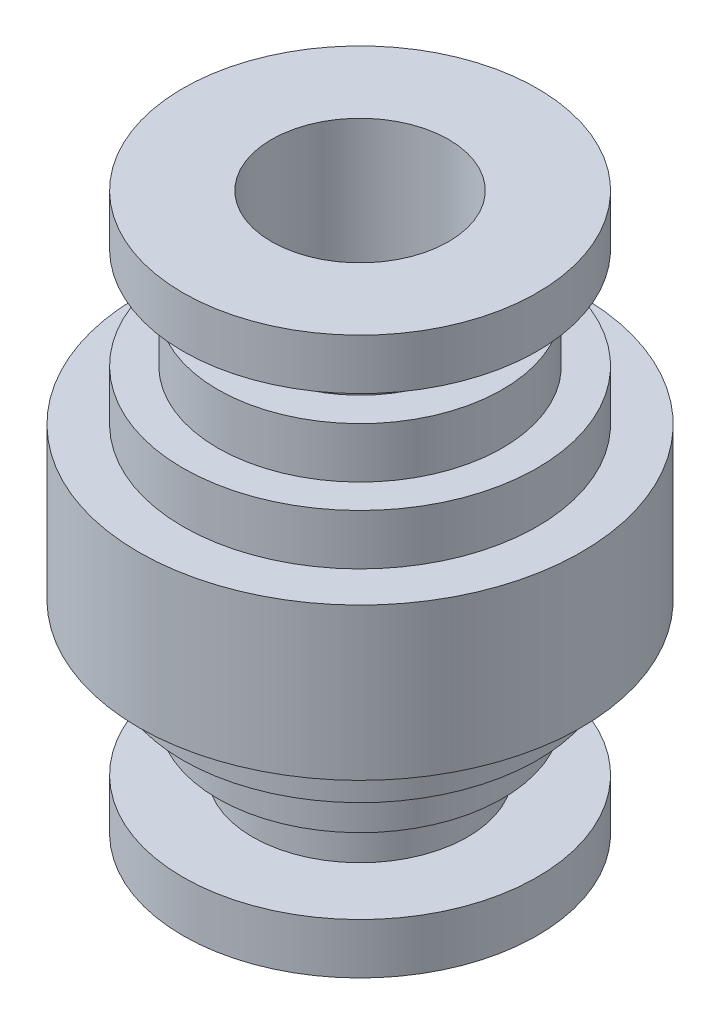
ISO-10303-21;
HEADER;
FILE_DESCRIPTION(('STEP AP214'),'2;1');
FILE_NAME('part.step','',(''),(''),'','','');
FILE_SCHEMA(('AUTOMOTIVE_DESIGN { 1 0 10303 214 1 1 1 1 }'));
ENDSEC;
DATA;
#1=APPLICATION_CONTEXT('core data for automotive mechanical design processes');
#2=APPLICATION_PROTOCOL_DEFINITION('international standard','automotive_design',2000,#1);
#3=PRODUCT_CONTEXT('',#1,'mechanical');
#4=PRODUCT('Part','Part','',(#3));
#5=PRODUCT_RELATED_PRODUCT_CATEGORY('part','',(#4));
#6=PRODUCT_DEFINITION_FORMATION('','',#4);
#7=PRODUCT_DEFINITION_CONTEXT('part definition',#1,'design');
#8=PRODUCT_DEFINITION('design','',#6,#7);
#9=PRODUCT_DEFINITION_SHAPE('','',#8);
#10=(LENGTH_UNIT() NAMED_UNIT(*) SI_UNIT(.MILLI.,.METRE.));
#11=(NAMED_UNIT(*) PLANE_ANGLE_UNIT() SI_UNIT($,.RADIAN.));
#12=(NAMED_UNIT(*) SI_UNIT($,.STERADIAN.) SOLID_ANGLE_UNIT());
#13=UNCERTAINTY_MEASURE_WITH_UNIT(LENGTH_MEASURE(1.E-05),#10,'distance_accuracy_value','');
#14=(GEOMETRIC_REPRESENTATION_CONTEXT(3) GLOBAL_UNCERTAINTY_ASSIGNED_CONTEXT((#13)) GLOBAL_UNIT_ASSIGNED_CONTEXT((#10,
#11,#12)) REPRESENTATION_CONTEXT('',''));
#15=CARTESIAN_POINT('',(0.,0.,0.));
#16=DIRECTION('',(0.,0.,1.));
#17=DIRECTION('',(1.,0.,0.));
#18=AXIS2_PLACEMENT_3D('',#15,#16,#17);
#19=CARTESIAN_POINT('',(0.,0.,0.));
#20=DIRECTION('',(0.,1.,0.));
#21=DIRECTION('',(0.,0.,1.));
#22=AXIS2_PLACEMENT_3D('',#19,#20,#21);
#23=CYLINDRICAL_SURFACE('',#22,8.75);
#24=CARTESIAN_POINT('',(0.,-3.,0.));
#25=DIRECTION('',(0.,1.,0.));
#26=DIRECTION('',(0.,0.,1.));
#27=AXIS2_PLACEMENT_3D('',#24,#25,#26);
#28=CIRCLE('',#27,8.75);
#29=CARTESIAN_POINT('',(0.,-3.,8.75));
#30=VERTEX_POINT('',#29);
#31=EDGE_CURVE('E18',#30,#30,#28,.T.);
#32=ORIENTED_EDGE('',*,*,#31,.T.);
#33=EDGE_LOOP('',(#32));
#34=FACE_BOUND('',#33,.T.);
#35=CARTESIAN_POINT('',(0.,3.,0.));
#36=DIRECTION('',(0.,1.,0.));
#37=DIRECTION('',(0.,0.,1.));
#38=AXIS2_PLACEMENT_3D('',#35,#36,#37);
#39=CIRCLE('',#38,8.75);
#40=CARTESIAN_POINT('',(0.,3.,8.75));
#41=VERTEX_POINT('',#40);
#42=EDGE_CURVE('E76',#41,#41,#39,.T.);
#43=ORIENTED_EDGE('',*,*,#42,.F.);
#44=EDGE_LOOP('',(#43));
#45=FACE_BOUND('',#44,.T.);
#46=ADVANCED_FACE('F15',(#34,#45),#23,.T.);
#47=CARTESIAN_POINT('',(0.,-3.,0.));
#48=DIRECTION('',(0.,1.,0.));
#49=DIRECTION('',(0.,0.,1.));
#50=AXIS2_PLACEMENT_3D('',#47,#48,#49);
#51=PLANE('',#50);
#52=CARTESIAN_POINT('',(0.,-3.,0.));
#53=DIRECTION('',(0.,1.,0.));
#54=DIRECTION('',(0.,0.,1.));
#55=AXIS2_PLACEMENT_3D('',#52,#53,#54);
#56=CIRCLE('',#55,7.);
#57=CARTESIAN_POINT('',(0.,-3.,7.));
#58=VERTEX_POINT('',#57);
#59=EDGE_CURVE('E74',#58,#58,#56,.F.);
#60=ORIENTED_EDGE('',*,*,#59,.F.);
#61=EDGE_LOOP('',(#60));
#62=FACE_BOUND('',#61,.T.);
#63=ORIENTED_EDGE('',*,*,#31,.F.);
#64=EDGE_LOOP('',(#63));
#65=FACE_BOUND('',#64,.T.);
#66=ADVANCED_FACE('F85',(#62,#65),#51,.F.);
#67=CARTESIAN_POINT('',(0.,3.,0.));
#68=DIRECTION('',(0.,1.,0.));
#69=DIRECTION('',(0.,0.,1.));
#70=AXIS2_PLACEMENT_3D('',#67,#68,#69);
#71=PLANE('',#70);
#72=CARTESIAN_POINT('',(0.,3.,0.));
#73=DIRECTION('',(0.,1.,0.));
#74=DIRECTION('',(0.,0.,1.));
#75=AXIS2_PLACEMENT_3D('',#72,#73,#74);
#76=CIRCLE('',#75,7.);
#77=CARTESIAN_POINT('',(0.,3.,7.));
#78=VERTEX_POINT('',#77);
#79=EDGE_CURVE('E71',#78,#78,#76,.T.);
#80=ORIENTED_EDGE('',*,*,#79,.F.);
#81=EDGE_LOOP('',(#80));
#82=FACE_BOUND('',#81,.T.);
#83=ORIENTED_EDGE('',*,*,#42,.T.);
#84=EDGE_LOOP('',(#83));
#85=FACE_BOUND('',#84,.T.);
#86=ADVANCED_FACE('F87',(#82,#85),#71,.T.);
#87=CARTESIAN_POINT('',(0.,-3.,0.));
#88=DIRECTION('',(0.,1.,0.));
#89=DIRECTION('',(0.,0.,1.));
#90=AXIS2_PLACEMENT_3D('',#87,#88,#89);
#91=CYLINDRICAL_SURFACE('',#90,7.);
#92=ORIENTED_EDGE('',*,*,#59,.T.);
#93=EDGE_LOOP('',(#92));
#94=FACE_BOUND('',#93,.T.);
#95=CARTESIAN_POINT('',(0.,-5.,0.));
#96=DIRECTION('',(0.,1.,0.));
#97=DIRECTION('',(0.,0.,1.));
#98=AXIS2_PLACEMENT_3D('',#95,#96,#97);
#99=CIRCLE('',#98,7.);
#100=CARTESIAN_POINT('',(0.,-5.,7.));
#101=VERTEX_POINT('',#100);
#102=EDGE_CURVE('E68',#101,#101,#99,.T.);
#103=ORIENTED_EDGE('',*,*,#102,.T.);
#104=EDGE_LOOP('',(#103));
#105=FACE_BOUND('',#104,.T.);
#106=ADVANCED_FACE('F94',(#94,#105),#91,.T.);
#107=CARTESIAN_POINT('',(0.,3.,0.));
#108=DIRECTION('',(0.,1.,0.));
#109=DIRECTION('',(0.,0.,1.));
#110=AXIS2_PLACEMENT_3D('',#107,#108,#109);
#111=CYLINDRICAL_SURFACE('',#110,7.);
#112=ORIENTED_EDGE('',*,*,#79,.T.);
#113=EDGE_LOOP('',(#112));
#114=FACE_BOUND('',#113,.T.);
#115=CARTESIAN_POINT('',(0.,5.,0.));
#116=DIRECTION('',(0.,1.,0.));
#117=DIRECTION('',(0.,0.,1.));
#118=AXIS2_PLACEMENT_3D('',#115,#116,#117);
#119=CIRCLE('',#118,7.);
#120=CARTESIAN_POINT('',(0.,5.,7.));
#121=VERTEX_POINT('',#120);
#122=EDGE_CURVE('E65',#121,#121,#119,.T.);
#123=ORIENTED_EDGE('',*,*,#122,.F.);
#124=EDGE_LOOP('',(#123));
#125=FACE_BOUND('',#124,.T.);
#126=ADVANCED_FACE('F161',(#114,#125),#111,.T.);
#127=CARTESIAN_POINT('',(0.,-5.,0.));
#128=DIRECTION('',(0.,1.,0.));
#129=DIRECTION('',(0.,0.,1.));
#130=AXIS2_PLACEMENT_3D('',#127,#128,#129);
#131=PLANE('',#130);
#132=CARTESIAN_POINT('',(0.,-5.,0.));
#133=DIRECTION('',(0.,1.,0.));
#134=DIRECTION('',(0.,0.,1.));
#135=AXIS2_PLACEMENT_3D('',#132,#133,#134);
#136=CIRCLE('',#135,5.625);
#137=CARTESIAN_POINT('',(0.,-5.,5.625));
#138=VERTEX_POINT('',#137);
#139=EDGE_CURVE('E62',#138,#138,#136,.F.);
#140=ORIENTED_EDGE('',*,*,#139,.F.);
#141=EDGE_LOOP('',(#140));
#142=FACE_BOUND('',#141,.T.);
#143=ORIENTED_EDGE('',*,*,#102,.F.);
#144=EDGE_LOOP('',(#143));
#145=FACE_BOUND('',#144,.T.);
#146=ADVANCED_FACE('F157',(#142,#145),#131,.F.);
#147=CARTESIAN_POINT('',(0.,5.,0.));
#148=DIRECTION('',(0.,1.,0.));
#149=DIRECTION('',(0.,0.,1.));
#150=AXIS2_PLACEMENT_3D('',#147,#148,#149);
#151=PLANE('',#150);
#152=CARTESIAN_POINT('',(0.,5.,0.));
#153=DIRECTION('',(0.,1.,0.));
#154=DIRECTION('',(0.,0.,1.));
#155=AXIS2_PLACEMENT_3D('',#152,#153,#154);
#156=CIRCLE('',#155,5.625);
#157=CARTESIAN_POINT('',(0.,5.,5.625));
#158=VERTEX_POINT('',#157);
#159=EDGE_CURVE('E59',#158,#158,#156,.T.);
#160=ORIENTED_EDGE('',*,*,#159,.F.);
#161=EDGE_LOOP('',(#160));
#162=FACE_BOUND('',#161,.T.);
#163=ORIENTED_EDGE('',*,*,#122,.T.);
#164=EDGE_LOOP('',(#163));
#165=FACE_BOUND('',#164,.T.);
#166=ADVANCED_FACE('F153',(#162,#165),#151,.T.);
#167=CARTESIAN_POINT('',(0.,-5.,0.));
#168=DIRECTION('',(0.,1.,0.));
#169=DIRECTION('',(0.,0.,1.));
#170=AXIS2_PLACEMENT_3D('',#167,#168,#169);
#171=CYLINDRICAL_SURFACE('',#170,5.625);
#172=ORIENTED_EDGE('',*,*,#139,.T.);
#173=EDGE_LOOP('',(#172));
#174=FACE_BOUND('',#173,.T.);
#175=CARTESIAN_POINT('',(0.,-7.,0.));
#176=DIRECTION('',(0.,1.,0.));
#177=DIRECTION('',(0.,0.,1.));
#178=AXIS2_PLACEMENT_3D('',#175,#176,#177);
#179=CIRCLE('',#178,5.625);
#180=CARTESIAN_POINT('',(0.,-7.,5.625));
#181=VERTEX_POINT('',#180);
#182=EDGE_CURVE('E56',#181,#181,#179,.T.);
#183=ORIENTED_EDGE('',*,*,#182,.T.);
#184=EDGE_LOOP('',(#183));
#185=FACE_BOUND('',#184,.T.);
#186=ADVANCED_FACE('F149',(#174,#185),#171,.T.);
#187=CARTESIAN_POINT('',(0.,5.,0.));
#188=DIRECTION('',(0.,1.,0.));
#189=DIRECTION('',(0.,0.,1.));
#190=AXIS2_PLACEMENT_3D('',#187,#188,#189);
#191=CYLINDRICAL_SURFACE('',#190,5.625);
#192=ORIENTED_EDGE('',*,*,#159,.T.);
#193=EDGE_LOOP('',(#192));
#194=FACE_BOUND('',#193,.T.);
#195=CARTESIAN_POINT('',(0.,7.,0.));
#196=DIRECTION('',(0.,1.,0.));
#197=DIRECTION('',(0.,0.,1.));
#198=AXIS2_PLACEMENT_3D('',#195,#196,#197);
#199=CIRCLE('',#198,5.625);
#200=CARTESIAN_POINT('',(0.,7.,5.625));
#201=VERTEX_POINT('',#200);
#202=EDGE_CURVE('E53',#201,#201,#199,.T.);
#203=ORIENTED_EDGE('',*,*,#202,.F.);
#204=EDGE_LOOP('',(#203));
#205=FACE_BOUND('',#204,.T.);
#206=ADVANCED_FACE('F145',(#194,#205),#191,.T.);
#207=CARTESIAN_POINT('',(0.,-7.,0.));
#208=DIRECTION('',(0.,1.,0.));
#209=DIRECTION('',(0.,0.,1.));
#210=AXIS2_PLACEMENT_3D('',#207,#208,#209);
#211=PLANE('',#210);
#212=CARTESIAN_POINT('',(0.,-7.,0.));
#213=DIRECTION('',(0.,1.,0.));
#214=DIRECTION('',(0.,0.,1.));
#215=AXIS2_PLACEMENT_3D('',#212,#213,#214);
#216=CIRCLE('',#215,4.25);
#217=CARTESIAN_POINT('',(0.,-7.,4.25));
#218=VERTEX_POINT('',#217);
#219=EDGE_CURVE('E50',#218,#218,#216,.F.);
#220=ORIENTED_EDGE('',*,*,#219,.F.);
#221=EDGE_LOOP('',(#220));
#222=FACE_BOUND('',#221,.T.);
#223=ORIENTED_EDGE('',*,*,#182,.F.);
#224=EDGE_LOOP('',(#223));
#225=FACE_BOUND('',#224,.T.);
#226=ADVANCED_FACE('F141',(#222,#225),#211,.F.);
#227=CARTESIAN_POINT('',(0.,7.,0.));
#228=DIRECTION('',(0.,1.,0.));
#229=DIRECTION('',(0.,0.,1.));
#230=AXIS2_PLACEMENT_3D('',#227,#228,#229);
#231=PLANE('',#230);
#232=CARTESIAN_POINT('',(0.,7.,0.));
#233=DIRECTION('',(0.,1.,0.));
#234=DIRECTION('',(0.,0.,1.));
#235=AXIS2_PLACEMENT_3D('',#232,#233,#234);
#236=CIRCLE('',#235,4.25);
#237=CARTESIAN_POINT('',(0.,7.,4.25));
#238=VERTEX_POINT('',#237);
#239=EDGE_CURVE('E47',#238,#238,#236,.T.);
#240=ORIENTED_EDGE('',*,*,#239,.F.);
#241=EDGE_LOOP('',(#240));
#242=FACE_BOUND('',#241,.T.);
#243=ORIENTED_EDGE('',*,*,#202,.T.);
#244=EDGE_LOOP('',(#243));
#245=FACE_BOUND('',#244,.T.);
#246=ADVANCED_FACE('F137',(#242,#245),#231,.T.);
#247=CARTESIAN_POINT('',(0.,-7.,0.));
#248=DIRECTION('',(0.,1.,0.));
#249=DIRECTION('',(0.,0.,1.));
#250=AXIS2_PLACEMENT_3D('',#247,#248,#249);
#251=CYLINDRICAL_SURFACE('',#250,4.25);
#252=ORIENTED_EDGE('',*,*,#219,.T.);
#253=EDGE_LOOP('',(#252));
#254=FACE_BOUND('',#253,.T.);
#255=CARTESIAN_POINT('',(0.,-9.,0.));
#256=DIRECTION('',(0.,1.,0.));
#257=DIRECTION('',(0.,0.,1.));
#258=AXIS2_PLACEMENT_3D('',#255,#256,#257);
#259=CIRCLE('',#258,4.25);
#260=CARTESIAN_POINT('',(0.,-9.,4.25));
#261=VERTEX_POINT('',#260);
#262=EDGE_CURVE('E44',#261,#261,#259,.F.);
#263=ORIENTED_EDGE('',*,*,#262,.F.);
#264=EDGE_LOOP('',(#263));
#265=FACE_BOUND('',#264,.T.);
#266=ADVANCED_FACE('F133',(#254,#265),#251,.T.);
#267=CARTESIAN_POINT('',(0.,7.,0.));
#268=DIRECTION('',(0.,1.,0.));
#269=DIRECTION('',(0.,0.,1.));
#270=AXIS2_PLACEMENT_3D('',#267,#268,#269);
#271=CYLINDRICAL_SURFACE('',#270,4.25);
#272=ORIENTED_EDGE('',*,*,#239,.T.);
#273=EDGE_LOOP('',(#272));
#274=FACE_BOUND('',#273,.T.);
#275=CARTESIAN_POINT('',(0.,9.,0.));
#276=DIRECTION('',(0.,1.,0.));
#277=DIRECTION('',(0.,0.,1.));
#278=AXIS2_PLACEMENT_3D('',#275,#276,#277);
#279=CIRCLE('',#278,4.25);
#280=CARTESIAN_POINT('',(0.,9.,4.25));
#281=VERTEX_POINT('',#280);
#282=EDGE_CURVE('E41',#281,#281,#279,.F.);
#283=ORIENTED_EDGE('',*,*,#282,.T.);
#284=EDGE_LOOP('',(#283));
#285=FACE_BOUND('',#284,.T.);
#286=ADVANCED_FACE('F129',(#274,#285),#271,.T.);
#287=CARTESIAN_POINT('',(0.,-9.,0.));
#288=DIRECTION('',(0.,1.,0.));
#289=DIRECTION('',(0.,0.,1.));
#290=AXIS2_PLACEMENT_3D('',#287,#288,#289);
#291=PLANE('',#290);
#292=ORIENTED_EDGE('',*,*,#262,.T.);
#293=EDGE_LOOP('',(#292));
#294=FACE_BOUND('',#293,.T.);
#295=CARTESIAN_POINT('',(0.,-9.,0.));
#296=DIRECTION('',(0.,1.,0.));
#297=DIRECTION('',(0.,0.,1.));
#298=AXIS2_PLACEMENT_3D('',#295,#296,#297);
#299=CIRCLE('',#298,7.);
#300=CARTESIAN_POINT('',(0.,-9.,7.));
#301=VERTEX_POINT('',#300);
#302=EDGE_CURVE('E38',#301,#301,#299,.F.);
#303=ORIENTED_EDGE('',*,*,#302,.F.);
#304=EDGE_LOOP('',(#303));
#305=FACE_BOUND('',#304,.T.);
#306=ADVANCED_FACE('F125',(#294,#305),#291,.T.);
#307=CARTESIAN_POINT('',(0.,9.,0.));
#308=DIRECTION('',(0.,1.,0.));
#309=DIRECTION('',(0.,0.,1.));
#310=AXIS2_PLACEMENT_3D('',#307,#308,#309);
#311=PLANE('',#310);
#312=ORIENTED_EDGE('',*,*,#282,.F.);
#313=EDGE_LOOP('',(#312));
#314=FACE_BOUND('',#313,.T.);
#315=CARTESIAN_POINT('',(0.,9.,0.));
#316=DIRECTION('',(0.,1.,0.));
#317=DIRECTION('',(0.,0.,1.));
#318=AXIS2_PLACEMENT_3D('',#315,#316,#317);
#319=CIRCLE('',#318,7.);
#320=CARTESIAN_POINT('',(0.,9.,7.));
#321=VERTEX_POINT('',#320);
#322=EDGE_CURVE('E35',#321,#321,#319,.T.);
#323=ORIENTED_EDGE('',*,*,#322,.F.);
#324=EDGE_LOOP('',(#323));
#325=FACE_BOUND('',#324,.T.);
#326=ADVANCED_FACE('F121',(#314,#325),#311,.F.);
#327=CARTESIAN_POINT('',(0.,-9.,0.));
#328=DIRECTION('',(0.,1.,0.));
#329=DIRECTION('',(0.,0.,1.));
#330=AXIS2_PLACEMENT_3D('',#327,#328,#329);
#331=CYLINDRICAL_SURFACE('',#330,7.);
#332=ORIENTED_EDGE('',*,*,#302,.T.);
#333=EDGE_LOOP('',(#332));
#334=FACE_BOUND('',#333,.T.);
#335=CARTESIAN_POINT('',(0.,-11.,0.));
#336=DIRECTION('',(0.,1.,0.));
#337=DIRECTION('',(0.,0.,1.));
#338=AXIS2_PLACEMENT_3D('',#335,#336,#337);
#339=CIRCLE('',#338,7.);
#340=CARTESIAN_POINT('',(0.,-11.,7.));
#341=VERTEX_POINT('',#340);
#342=EDGE_CURVE('E32',#341,#341,#339,.T.);
#343=ORIENTED_EDGE('',*,*,#342,.T.);
#344=EDGE_LOOP('',(#343));
#345=FACE_BOUND('',#344,.T.);
#346=ADVANCED_FACE('F117',(#334,#345),#331,.T.);
#347=CARTESIAN_POINT('',(0.,9.,0.));
#348=DIRECTION('',(0.,1.,0.));
#349=DIRECTION('',(0.,0.,1.));
#350=AXIS2_PLACEMENT_3D('',#347,#348,#349);
#351=CYLINDRICAL_SURFACE('',#350,7.);
#352=ORIENTED_EDGE('',*,*,#322,.T.);
#353=EDGE_LOOP('',(#352));
#354=FACE_BOUND('',#353,.T.);
#355=CARTESIAN_POINT('',(0.,11.,0.));
#356=DIRECTION('',(0.,1.,0.));
#357=DIRECTION('',(0.,0.,1.));
#358=AXIS2_PLACEMENT_3D('',#355,#356,#357);
#359=CIRCLE('',#358,7.);
#360=CARTESIAN_POINT('',(0.,11.,7.));
#361=VERTEX_POINT('',#360);
#362=EDGE_CURVE('E27',#361,#361,#359,.T.);
#363=ORIENTED_EDGE('',*,*,#362,.F.);
#364=EDGE_LOOP('',(#363));
#365=FACE_BOUND('',#364,.T.);
#366=ADVANCED_FACE('F113',(#354,#365),#351,.T.);
#367=CARTESIAN_POINT('',(0.,-11.,0.));
#368=DIRECTION('',(0.,1.,0.));
#369=DIRECTION('',(0.,0.,1.));
#370=AXIS2_PLACEMENT_3D('',#367,#368,#369);
#371=PLANE('',#370);
#372=CARTESIAN_POINT('',(0.,-11.,0.));
#373=DIRECTION('',(0.,1.,0.));
#374=DIRECTION('',(0.,0.,1.));
#375=AXIS2_PLACEMENT_3D('',#372,#373,#374);
#376=CIRCLE('',#375,3.5);
#377=CARTESIAN_POINT('',(0.,-11.,3.5));
#378=VERTEX_POINT('',#377);
#379=EDGE_CURVE('E22',#378,#378,#376,.T.);
#380=ORIENTED_EDGE('',*,*,#379,.T.);
#381=EDGE_LOOP('',(#380));
#382=FACE_BOUND('',#381,.T.);
#383=ORIENTED_EDGE('',*,*,#342,.F.);
#384=EDGE_LOOP('',(#383));
#385=FACE_BOUND('',#384,.T.);
#386=ADVANCED_FACE('F106',(#382,#385),#371,.F.);
#387=CARTESIAN_POINT('',(0.,11.,0.));
#388=DIRECTION('',(0.,1.,0.));
#389=DIRECTION('',(0.,0.,1.));
#390=AXIS2_PLACEMENT_3D('',#387,#388,#389);
#391=PLANE('',#390);
#392=CARTESIAN_POINT('',(0.,11.,0.));
#393=DIRECTION('',(0.,1.,0.));
#394=DIRECTION('',(0.,0.,1.));
#395=AXIS2_PLACEMENT_3D('',#392,#393,#394);
#396=CIRCLE('',#395,3.5);
#397=CARTESIAN_POINT('',(0.,11.,3.5));
#398=VERTEX_POINT('',#397);
#399=EDGE_CURVE('E10',#398,#398,#396,.F.);
#400=ORIENTED_EDGE('',*,*,#399,.T.);
#401=EDGE_LOOP('',(#400));
#402=FACE_BOUND('',#401,.T.);
#403=ORIENTED_EDGE('',*,*,#362,.T.);
#404=EDGE_LOOP('',(#403));
#405=FACE_BOUND('',#404,.T.);
#406=ADVANCED_FACE('F100',(#402,#405),#391,.T.);
#407=CARTESIAN_POINT('',(0.,0.,0.));
#408=DIRECTION('',(0.,1.,0.));
#409=DIRECTION('',(0.,0.,1.));
#410=AXIS2_PLACEMENT_3D('',#407,#408,#409);
#411=CYLINDRICAL_SURFACE('',#410,3.5);
#412=ORIENTED_EDGE('',*,*,#379,.F.);
#413=EDGE_LOOP('',(#412));
#414=FACE_BOUND('',#413,.T.);
#415=ORIENTED_EDGE('',*,*,#399,.F.);
#416=EDGE_LOOP('',(#415));
#417=FACE_BOUND('',#416,.T.);
#418=ADVANCED_FACE('F98',(#414,#417),#411,.F.);
#419=CLOSED_SHELL('',(#46,#66,#86,#106,#126,#146,#166,#186,#206,#226,#246,#266,#286,#306,#326,
#346,#366,#386,#406,#418));
#420=MANIFOLD_SOLID_BREP('B1',#419);
#421=ADVANCED_BREP_SHAPE_REPRESENTATION('',(#18,#420),#14);
#422=SHAPE_DEFINITION_REPRESENTATION(#9,#421);
ENDSEC;
END-ISO-10303-21;
